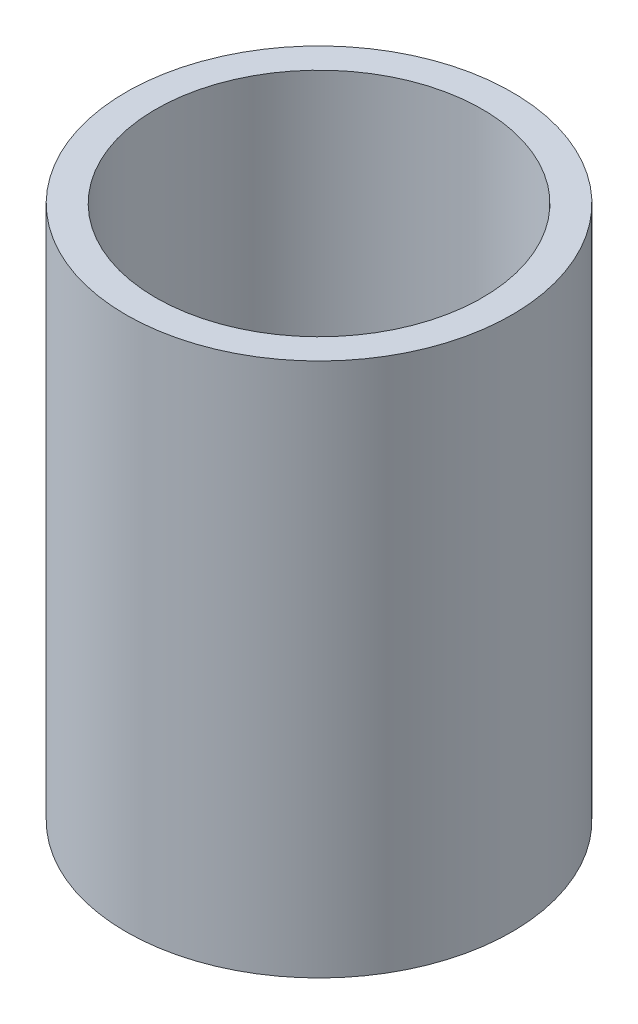
ISO-10303-21;
HEADER;
FILE_DESCRIPTION(('STEP AP214'),'2;1');
FILE_NAME('part.step','',(''),(''),'','','');
FILE_SCHEMA(('AUTOMOTIVE_DESIGN { 1 0 10303 214 1 1 1 1 }'));
ENDSEC;
DATA;
#1=APPLICATION_CONTEXT('core data for automotive mechanical design processes');
#2=APPLICATION_PROTOCOL_DEFINITION('international standard','automotive_design',2000,#1);
#3=PRODUCT_CONTEXT('',#1,'mechanical');
#4=PRODUCT('Part','Part','',(#3));
#5=PRODUCT_RELATED_PRODUCT_CATEGORY('part','',(#4));
#6=PRODUCT_DEFINITION_FORMATION('','',#4);
#7=PRODUCT_DEFINITION_CONTEXT('part definition',#1,'design');
#8=PRODUCT_DEFINITION('design','',#6,#7);
#9=PRODUCT_DEFINITION_SHAPE('','',#8);
#10=(LENGTH_UNIT() NAMED_UNIT(*) SI_UNIT(.MILLI.,.METRE.));
#11=(NAMED_UNIT(*) PLANE_ANGLE_UNIT() SI_UNIT($,.RADIAN.));
#12=(NAMED_UNIT(*) SI_UNIT($,.STERADIAN.) SOLID_ANGLE_UNIT());
#13=UNCERTAINTY_MEASURE_WITH_UNIT(LENGTH_MEASURE(1.E-05),#10,'distance_accuracy_value','');
#14=(GEOMETRIC_REPRESENTATION_CONTEXT(3) GLOBAL_UNCERTAINTY_ASSIGNED_CONTEXT((#13)) GLOBAL_UNIT_ASSIGNED_CONTEXT((#10,
#11,#12)) REPRESENTATION_CONTEXT('',''));
#15=CARTESIAN_POINT('',(0.,0.,0.));
#16=DIRECTION('',(0.,0.,1.));
#17=DIRECTION('',(1.,0.,0.));
#18=AXIS2_PLACEMENT_3D('',#15,#16,#17);
#19=CARTESIAN_POINT('',(0.,9.,0.));
#20=DIRECTION('',(0.,1.,0.));
#21=DIRECTION('',(0.,0.,1.));
#22=AXIS2_PLACEMENT_3D('',#19,#20,#21);
#23=PLANE('',#22);
#24=CARTESIAN_POINT('',(0.,9.,0.));
#25=DIRECTION('',(0.,1.,0.));
#26=DIRECTION('',(0.,0.,1.));
#27=AXIS2_PLACEMENT_3D('',#24,#25,#26);
#28=CIRCLE('',#27,3.25);
#29=CARTESIAN_POINT('',(0.,9.,3.25));
#30=VERTEX_POINT('',#29);
#31=EDGE_CURVE('E10',#30,#30,#28,.T.);
#32=ORIENTED_EDGE('',*,*,#31,.T.);
#33=EDGE_LOOP('',(#32));
#34=FACE_BOUND('',#33,.T.);
#35=CARTESIAN_POINT('',(0.,9.,0.));
#36=DIRECTION('',(0.,1.,0.));
#37=DIRECTION('',(0.,0.,1.));
#38=AXIS2_PLACEMENT_3D('',#35,#36,#37);
#39=CIRCLE('',#38,2.75);
#40=CARTESIAN_POINT('',(0.,9.,2.75));
#41=VERTEX_POINT('',#40);
#42=EDGE_CURVE('E41',#41,#41,#39,.T.);
#43=ORIENTED_EDGE('',*,*,#42,.F.);
#44=EDGE_LOOP('',(#43));
#45=FACE_BOUND('',#44,.T.);
#46=ADVANCED_FACE('F30',(#34,#45),#23,.T.);
#47=CARTESIAN_POINT('',(0.,0.,0.));
#48=DIRECTION('',(0.,1.,0.));
#49=DIRECTION('',(0.,0.,1.));
#50=AXIS2_PLACEMENT_3D('',#47,#48,#49);
#51=PLANE('',#50);
#52=CARTESIAN_POINT('',(0.,0.,0.));
#53=DIRECTION('',(0.,1.,0.));
#54=DIRECTION('',(0.,0.,1.));
#55=AXIS2_PLACEMENT_3D('',#52,#53,#54);
#56=CIRCLE('',#55,3.25);
#57=CARTESIAN_POINT('',(0.,0.,3.25));
#58=VERTEX_POINT('',#57);
#59=EDGE_CURVE('E34',#58,#58,#56,.T.);
#60=ORIENTED_EDGE('',*,*,#59,.F.);
#61=EDGE_LOOP('',(#60));
#62=FACE_BOUND('',#61,.T.);
#63=CARTESIAN_POINT('',(0.,0.,0.));
#64=DIRECTION('',(0.,1.,0.));
#65=DIRECTION('',(0.,0.,1.));
#66=AXIS2_PLACEMENT_3D('',#63,#64,#65);
#67=CIRCLE('',#66,2.75);
#68=CARTESIAN_POINT('',(0.,0.,2.75));
#69=VERTEX_POINT('',#68);
#70=EDGE_CURVE('E43',#69,#69,#67,.T.);
#71=ORIENTED_EDGE('',*,*,#70,.T.);
#72=EDGE_LOOP('',(#71));
#73=FACE_BOUND('',#72,.T.);
#74=ADVANCED_FACE('F53',(#62,#73),#51,.F.);
#75=CARTESIAN_POINT('',(0.,9.,0.));
#76=DIRECTION('',(0.,-1.,0.));
#77=DIRECTION('',(0.,0.,-1.));
#78=AXIS2_PLACEMENT_3D('',#75,#76,#77);
#79=CYLINDRICAL_SURFACE('',#78,3.25);
#80=ORIENTED_EDGE('',*,*,#31,.F.);
#81=EDGE_LOOP('',(#80));
#82=FACE_BOUND('',#81,.T.);
#83=ORIENTED_EDGE('',*,*,#59,.T.);
#84=EDGE_LOOP('',(#83));
#85=FACE_BOUND('',#84,.T.);
#86=ADVANCED_FACE('F32',(#82,#85),#79,.T.);
#87=CARTESIAN_POINT('',(0.,9.,0.));
#88=DIRECTION('',(0.,-1.,0.));
#89=DIRECTION('',(0.,0.,-1.));
#90=AXIS2_PLACEMENT_3D('',#87,#88,#89);
#91=CYLINDRICAL_SURFACE('',#90,2.75);
#92=ORIENTED_EDGE('',*,*,#42,.T.);
#93=EDGE_LOOP('',(#92));
#94=FACE_BOUND('',#93,.T.);
#95=ORIENTED_EDGE('',*,*,#70,.F.);
#96=EDGE_LOOP('',(#95));
#97=FACE_BOUND('',#96,.T.);
#98=ADVANCED_FACE('F49',(#94,#97),#91,.F.);
#99=CLOSED_SHELL('',(#46,#74,#86,#98));
#100=MANIFOLD_SOLID_BREP('B2',#99);
#101=ADVANCED_BREP_SHAPE_REPRESENTATION('',(#18,#100),#14);
#102=SHAPE_DEFINITION_REPRESENTATION(#9,#101);
ENDSEC;
END-ISO-10303-21;
